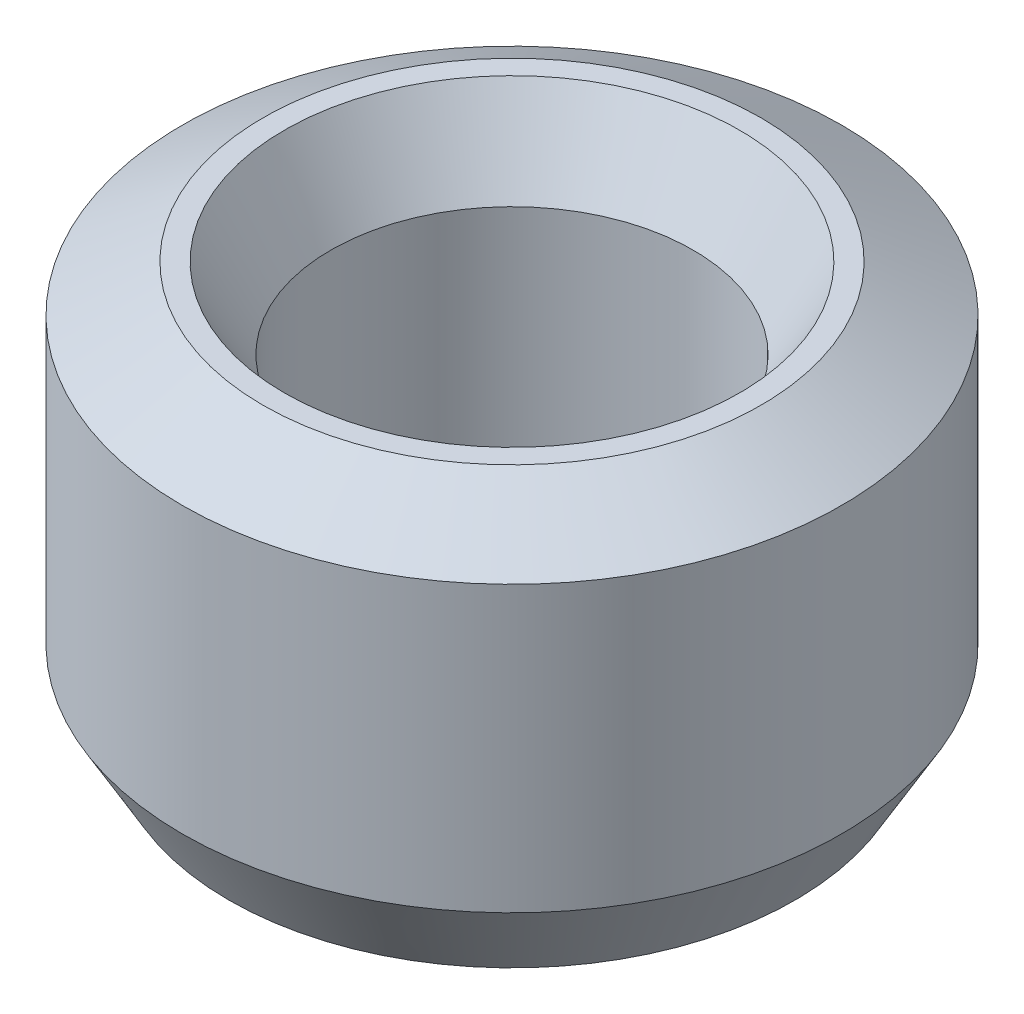
ISO-10303-21;
HEADER;
FILE_DESCRIPTION(('STEP AP214'),'2;1');
FILE_NAME('part.step','',(''),(''),'','','');
FILE_SCHEMA(('AUTOMOTIVE_DESIGN { 1 0 10303 214 1 1 1 1 }'));
ENDSEC;
DATA;
#1=APPLICATION_CONTEXT('core data for automotive mechanical design processes');
#2=APPLICATION_PROTOCOL_DEFINITION('international standard','automotive_design',2000,#1);
#3=PRODUCT_CONTEXT('',#1,'mechanical');
#4=PRODUCT('Part','Part','',(#3));
#5=PRODUCT_RELATED_PRODUCT_CATEGORY('part','',(#4));
#6=PRODUCT_DEFINITION_FORMATION('','',#4);
#7=PRODUCT_DEFINITION_CONTEXT('part definition',#1,'design');
#8=PRODUCT_DEFINITION('design','',#6,#7);
#9=PRODUCT_DEFINITION_SHAPE('','',#8);
#10=(LENGTH_UNIT() NAMED_UNIT(*) SI_UNIT(.MILLI.,.METRE.));
#11=(NAMED_UNIT(*) PLANE_ANGLE_UNIT() SI_UNIT($,.RADIAN.));
#12=(NAMED_UNIT(*) SI_UNIT($,.STERADIAN.) SOLID_ANGLE_UNIT());
#13=UNCERTAINTY_MEASURE_WITH_UNIT(LENGTH_MEASURE(1.E-05),#10,'distance_accuracy_value','');
#14=(GEOMETRIC_REPRESENTATION_CONTEXT(3) GLOBAL_UNCERTAINTY_ASSIGNED_CONTEXT((#13)) GLOBAL_UNIT_ASSIGNED_CONTEXT((#10,
#11,#12)) REPRESENTATION_CONTEXT('',''));
#15=CARTESIAN_POINT('',(0.,0.,0.));
#16=DIRECTION('',(0.,0.,1.));
#17=DIRECTION('',(1.,0.,0.));
#18=AXIS2_PLACEMENT_3D('',#15,#16,#17);
#19=CARTESIAN_POINT('',(0.,6.24452599573309,0.));
#20=DIRECTION('',(0.,-1.,0.));
#21=DIRECTION('',(0.,0.,-1.));
#22=AXIS2_PLACEMENT_3D('',#19,#20,#21);
#23=CYLINDRICAL_SURFACE('',#22,5.);
#24=CARTESIAN_POINT('',(0.,1.22229892306272,0.));
#25=DIRECTION('',(0.,1.,0.));
#26=DIRECTION('',(0.,0.,1.));
#27=AXIS2_PLACEMENT_3D('',#24,#25,#26);
#28=CIRCLE('',#27,5.);
#29=CARTESIAN_POINT('',(0.,1.22229892306272,5.));
#30=VERTEX_POINT('',#29);
#31=EDGE_CURVE('E10',#30,#30,#28,.T.);
#32=ORIENTED_EDGE('',*,*,#31,.T.);
#33=EDGE_LOOP('',(#32));
#34=FACE_BOUND('',#33,.T.);
#35=CARTESIAN_POINT('',(0.,5.53883138347264,0.));
#36=DIRECTION('',(0.,1.,0.));
#37=DIRECTION('',(0.,0.,1.));
#38=AXIS2_PLACEMENT_3D('',#35,#36,#37);
#39=CIRCLE('',#38,5.);
#40=CARTESIAN_POINT('',(0.,5.53883138347264,5.));
#41=VERTEX_POINT('',#40);
#42=EDGE_CURVE('E50',#41,#41,#39,.F.);
#43=ORIENTED_EDGE('',*,*,#42,.T.);
#44=EDGE_LOOP('',(#43));
#45=FACE_BOUND('',#44,.T.);
#46=ADVANCED_FACE('F39',(#34,#45),#23,.T.);
#47=CARTESIAN_POINT('',(0.,6.24452599573309,0.));
#48=DIRECTION('',(0.,1.,0.));
#49=DIRECTION('',(0.,0.,1.));
#50=AXIS2_PLACEMENT_3D('',#47,#48,#49);
#51=PLANE('',#50);
#52=CARTESIAN_POINT('',(0.,6.24452599573309,0.));
#53=DIRECTION('',(0.,1.,0.));
#54=DIRECTION('',(0.,0.,1.));
#55=AXIS2_PLACEMENT_3D('',#52,#53,#54);
#56=CIRCLE('',#55,3.45355456084804);
#57=CARTESIAN_POINT('',(0.,6.24452599573309,3.45355456084804));
#58=VERTEX_POINT('',#57);
#59=EDGE_CURVE('E58',#58,#58,#56,.F.);
#60=ORIENTED_EDGE('',*,*,#59,.T.);
#61=EDGE_LOOP('',(#60));
#62=FACE_BOUND('',#61,.T.);
#63=CARTESIAN_POINT('',(0.,6.24452599573309,0.));
#64=DIRECTION('',(0.,1.,0.));
#65=DIRECTION('',(0.,0.,1.));
#66=AXIS2_PLACEMENT_3D('',#63,#64,#65);
#67=CIRCLE('',#66,3.77770107693729);
#68=CARTESIAN_POINT('',(0.,6.24452599573309,3.77770107693729));
#69=VERTEX_POINT('',#68);
#70=EDGE_CURVE('E61',#69,#69,#67,.T.);
#71=ORIENTED_EDGE('',*,*,#70,.T.);
#72=EDGE_LOOP('',(#71));
#73=FACE_BOUND('',#72,.T.);
#74=ADVANCED_FACE('F88',(#62,#73),#51,.T.);
#75=CARTESIAN_POINT('',(0.,0.,0.));
#76=DIRECTION('',(0.,1.,0.));
#77=DIRECTION('',(0.,0.,1.));
#78=AXIS2_PLACEMENT_3D('',#75,#76,#77);
#79=PLANE('',#78);
#80=CARTESIAN_POINT('',(0.,0.,0.));
#81=DIRECTION('',(0.,1.,0.));
#82=DIRECTION('',(0.,0.,1.));
#83=AXIS2_PLACEMENT_3D('',#80,#81,#82);
#84=CIRCLE('',#83,3.97015887165031);
#85=CARTESIAN_POINT('',(0.,0.,3.97015887165031));
#86=VERTEX_POINT('',#85);
#87=EDGE_CURVE('E51',#86,#86,#84,.T.);
#88=ORIENTED_EDGE('',*,*,#87,.T.);
#89=EDGE_LOOP('',(#88));
#90=FACE_BOUND('',#89,.T.);
#91=CARTESIAN_POINT('',(0.,0.,0.));
#92=DIRECTION('',(0.,1.,0.));
#93=DIRECTION('',(0.,0.,1.));
#94=AXIS2_PLACEMENT_3D('',#91,#92,#93);
#95=CIRCLE('',#94,4.29430538773954);
#96=CARTESIAN_POINT('',(0.,0.,4.29430538773954));
#97=VERTEX_POINT('',#96);
#98=EDGE_CURVE('E54',#97,#97,#95,.F.);
#99=ORIENTED_EDGE('',*,*,#98,.T.);
#100=EDGE_LOOP('',(#99));
#101=FACE_BOUND('',#100,.T.);
#102=ADVANCED_FACE('F83',(#90,#101),#79,.F.);
#103=CARTESIAN_POINT('',(0.,6.24452599573309,0.));
#104=DIRECTION('',(0.,-1.,0.));
#105=DIRECTION('',(0.,0.,-1.));
#106=AXIS2_PLACEMENT_3D('',#103,#104,#105);
#107=CYLINDRICAL_SURFACE('',#106,2.74785994858759);
#108=CARTESIAN_POINT('',(0.,5.02222707267038,0.));
#109=DIRECTION('',(0.,1.,0.));
#110=DIRECTION('',(0.,0.,1.));
#111=AXIS2_PLACEMENT_3D('',#108,#109,#110);
#112=CIRCLE('',#111,2.74785994858759);
#113=CARTESIAN_POINT('',(0.,5.02222707267038,2.74785994858759));
#114=VERTEX_POINT('',#113);
#115=EDGE_CURVE('E67',#114,#114,#112,.T.);
#116=ORIENTED_EDGE('',*,*,#115,.T.);
#117=EDGE_LOOP('',(#116));
#118=FACE_BOUND('',#117,.T.);
#119=CARTESIAN_POINT('',(0.,0.705694612260452,0.));
#120=DIRECTION('',(0.,1.,0.));
#121=DIRECTION('',(0.,0.,1.));
#122=AXIS2_PLACEMENT_3D('',#119,#120,#121);
#123=CIRCLE('',#122,2.74785994858759);
#124=CARTESIAN_POINT('',(0.,0.705694612260452,2.74785994858759));
#125=VERTEX_POINT('',#124);
#126=EDGE_CURVE('E69',#125,#125,#123,.F.);
#127=ORIENTED_EDGE('',*,*,#126,.T.);
#128=EDGE_LOOP('',(#127));
#129=FACE_BOUND('',#128,.T.);
#130=ADVANCED_FACE('F71',(#118,#129),#107,.F.);
#131=CARTESIAN_POINT('',(0.,5.02222707267038,0.));
#132=DIRECTION('',(0.,1.,0.));
#133=DIRECTION('',(0.,0.,1.));
#134=AXIS2_PLACEMENT_3D('',#131,#132,#133);
#135=CONICAL_SURFACE('',#134,2.74785994858759,0.523598775598303);
#136=ORIENTED_EDGE('',*,*,#59,.F.);
#137=EDGE_LOOP('',(#136));
#138=FACE_BOUND('',#137,.T.);
#139=ORIENTED_EDGE('',*,*,#115,.F.);
#140=EDGE_LOOP('',(#139));
#141=FACE_BOUND('',#140,.T.);
#142=ADVANCED_FACE('F77',(#138,#141),#135,.F.);
#143=CARTESIAN_POINT('',(0.,0.,0.));
#144=DIRECTION('',(0.,-1.,0.));
#145=DIRECTION('',(0.,0.,-1.));
#146=AXIS2_PLACEMENT_3D('',#143,#144,#145);
#147=CONICAL_SURFACE('',#146,3.97015887165031,1.04719755119659);
#148=ORIENTED_EDGE('',*,*,#126,.F.);
#149=EDGE_LOOP('',(#148));
#150=FACE_BOUND('',#149,.T.);
#151=ORIENTED_EDGE('',*,*,#87,.F.);
#152=EDGE_LOOP('',(#151));
#153=FACE_BOUND('',#152,.T.);
#154=ADVANCED_FACE('F73',(#150,#153),#147,.F.);
#155=CARTESIAN_POINT('',(0.,1.22229892306272,0.));
#156=DIRECTION('',(0.,1.,0.));
#157=DIRECTION('',(0.,0.,1.));
#158=AXIS2_PLACEMENT_3D('',#155,#156,#157);
#159=CONICAL_SURFACE('',#158,5.,0.523598775598303);
#160=ORIENTED_EDGE('',*,*,#98,.F.);
#161=EDGE_LOOP('',(#160));
#162=FACE_BOUND('',#161,.T.);
#163=ORIENTED_EDGE('',*,*,#31,.F.);
#164=EDGE_LOOP('',(#163));
#165=FACE_BOUND('',#164,.T.);
#166=ADVANCED_FACE('F76',(#162,#165),#159,.T.);
#167=CARTESIAN_POINT('',(0.,6.24452599573309,0.));
#168=DIRECTION('',(0.,-1.,0.));
#169=DIRECTION('',(0.,0.,-1.));
#170=AXIS2_PLACEMENT_3D('',#167,#168,#169);
#171=CONICAL_SURFACE('',#170,3.77770107693729,1.04719755119659);
#172=ORIENTED_EDGE('',*,*,#42,.F.);
#173=EDGE_LOOP('',(#172));
#174=FACE_BOUND('',#173,.T.);
#175=ORIENTED_EDGE('',*,*,#70,.F.);
#176=EDGE_LOOP('',(#175));
#177=FACE_BOUND('',#176,.T.);
#178=ADVANCED_FACE('F45',(#174,#177),#171,.T.);
#179=CLOSED_SHELL('',(#46,#74,#102,#130,#142,#154,#166,#178));
#180=MANIFOLD_SOLID_BREP('B2',#179);
#181=ADVANCED_BREP_SHAPE_REPRESENTATION('',(#18,#180),#14);
#182=SHAPE_DEFINITION_REPRESENTATION(#9,#181);
ENDSEC;
END-ISO-10303-21;
